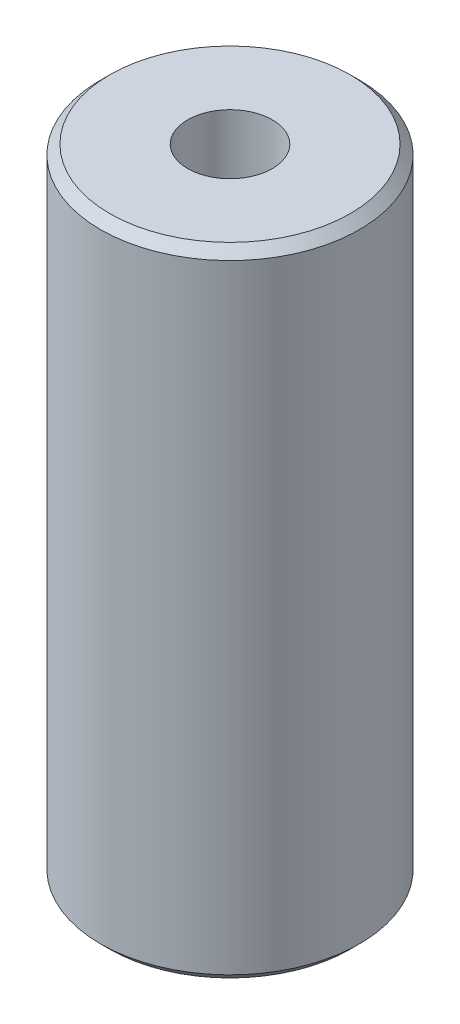
ISO-10303-21;
HEADER;
FILE_DESCRIPTION(('STEP AP214'),'2;1');
FILE_NAME('part.step','',(''),(''),'','','');
FILE_SCHEMA(('AUTOMOTIVE_DESIGN { 1 0 10303 214 1 1 1 1 }'));
ENDSEC;
DATA;
#1=APPLICATION_CONTEXT('core data for automotive mechanical design processes');
#2=APPLICATION_PROTOCOL_DEFINITION('international standard','automotive_design',2000,#1);
#3=PRODUCT_CONTEXT('',#1,'mechanical');
#4=PRODUCT('Part','Part','',(#3));
#5=PRODUCT_RELATED_PRODUCT_CATEGORY('part','',(#4));
#6=PRODUCT_DEFINITION_FORMATION('','',#4);
#7=PRODUCT_DEFINITION_CONTEXT('part definition',#1,'design');
#8=PRODUCT_DEFINITION('design','',#6,#7);
#9=PRODUCT_DEFINITION_SHAPE('','',#8);
#10=(LENGTH_UNIT() NAMED_UNIT(*) SI_UNIT(.MILLI.,.METRE.));
#11=(NAMED_UNIT(*) PLANE_ANGLE_UNIT() SI_UNIT($,.RADIAN.));
#12=(NAMED_UNIT(*) SI_UNIT($,.STERADIAN.) SOLID_ANGLE_UNIT());
#13=UNCERTAINTY_MEASURE_WITH_UNIT(LENGTH_MEASURE(1.E-05),#10,'distance_accuracy_value','');
#14=(GEOMETRIC_REPRESENTATION_CONTEXT(3) GLOBAL_UNCERTAINTY_ASSIGNED_CONTEXT((#13)) GLOBAL_UNIT_ASSIGNED_CONTEXT((#10,
#11,#12)) REPRESENTATION_CONTEXT('',''));
#15=CARTESIAN_POINT('',(0.,0.,0.));
#16=DIRECTION('',(0.,0.,1.));
#17=DIRECTION('',(1.,0.,0.));
#18=AXIS2_PLACEMENT_3D('',#15,#16,#17);
#19=CARTESIAN_POINT('',(0.,221.366290043515,0.));
#20=DIRECTION('',(0.,-1.,0.));
#21=DIRECTION('',(0.,0.,-1.));
#22=AXIS2_PLACEMENT_3D('',#19,#20,#21);
#23=CYLINDRICAL_SURFACE('',#22,45.);
#24=CARTESIAN_POINT('',(0.,218.158806298416,0.));
#25=DIRECTION('',(0.,1.,0.));
#26=DIRECTION('',(0.,0.,1.));
#27=AXIS2_PLACEMENT_3D('',#24,#25,#26);
#28=CIRCLE('',#27,45.);
#29=CARTESIAN_POINT('',(0.,218.158806298416,-45.));
#30=VERTEX_POINT('',#29);
#31=EDGE_CURVE('E50',#30,#30,#28,.F.);
#32=ORIENTED_EDGE('',*,*,#31,.T.);
#33=EDGE_LOOP('',(#32));
#34=FACE_BOUND('',#33,.T.);
#35=CARTESIAN_POINT('',(0.,3.20748374509863,0.));
#36=DIRECTION('',(0.,1.,0.));
#37=DIRECTION('',(0.,0.,1.));
#38=AXIS2_PLACEMENT_3D('',#35,#36,#37);
#39=CIRCLE('',#38,45.);
#40=CARTESIAN_POINT('',(0.,3.20748374509863,45.));
#41=VERTEX_POINT('',#40);
#42=EDGE_CURVE('E51',#41,#41,#39,.T.);
#43=ORIENTED_EDGE('',*,*,#42,.T.);
#44=EDGE_LOOP('',(#43));
#45=FACE_BOUND('',#44,.T.);
#46=ADVANCED_FACE('F39',(#34,#45),#23,.T.);
#47=CARTESIAN_POINT('',(0.,221.366290043515,0.));
#48=DIRECTION('',(0.,1.,0.));
#49=DIRECTION('',(0.,0.,1.));
#50=AXIS2_PLACEMENT_3D('',#47,#48,#49);
#51=PLANE('',#50);
#52=CARTESIAN_POINT('',(0.,221.366290043515,0.));
#53=DIRECTION('',(0.,1.,0.));
#54=DIRECTION('',(0.,0.,1.));
#55=AXIS2_PLACEMENT_3D('',#52,#53,#54);
#56=CIRCLE('',#55,41.7925162549013);
#57=CARTESIAN_POINT('',(0.,221.366290043515,-41.7925162549013));
#58=VERTEX_POINT('',#57);
#59=EDGE_CURVE('E54',#58,#58,#56,.T.);
#60=ORIENTED_EDGE('',*,*,#59,.T.);
#61=EDGE_LOOP('',(#60));
#62=FACE_BOUND('',#61,.T.);
#63=CARTESIAN_POINT('',(0.,221.366290043515,0.));
#64=DIRECTION('',(0.,1.,0.));
#65=DIRECTION('',(0.,0.,1.));
#66=AXIS2_PLACEMENT_3D('',#63,#64,#65);
#67=CIRCLE('',#66,14.7054693619186);
#68=CARTESIAN_POINT('',(0.,221.366290043515,14.7054693619186));
#69=VERTEX_POINT('',#68);
#70=EDGE_CURVE('E58',#69,#69,#67,.T.);
#71=ORIENTED_EDGE('',*,*,#70,.F.);
#72=EDGE_LOOP('',(#71));
#73=FACE_BOUND('',#72,.T.);
#74=ADVANCED_FACE('F69',(#62,#73),#51,.T.);
#75=CARTESIAN_POINT('',(0.,0.,0.));
#76=DIRECTION('',(0.,1.,0.));
#77=DIRECTION('',(0.,0.,1.));
#78=AXIS2_PLACEMENT_3D('',#75,#76,#77);
#79=PLANE('',#78);
#80=CARTESIAN_POINT('',(0.,0.,0.));
#81=DIRECTION('',(0.,1.,0.));
#82=DIRECTION('',(0.,0.,1.));
#83=AXIS2_PLACEMENT_3D('',#80,#81,#82);
#84=CIRCLE('',#83,41.7925162549014);
#85=CARTESIAN_POINT('',(0.,0.,41.7925162549014));
#86=VERTEX_POINT('',#85);
#87=EDGE_CURVE('E10',#86,#86,#84,.F.);
#88=ORIENTED_EDGE('',*,*,#87,.T.);
#89=EDGE_LOOP('',(#88));
#90=FACE_BOUND('',#89,.T.);
#91=CARTESIAN_POINT('',(0.,0.,0.));
#92=DIRECTION('',(0.,1.,0.));
#93=DIRECTION('',(0.,0.,1.));
#94=AXIS2_PLACEMENT_3D('',#91,#92,#93);
#95=CIRCLE('',#94,14.7054693619186);
#96=CARTESIAN_POINT('',(0.,0.,14.7054693619186));
#97=VERTEX_POINT('',#96);
#98=EDGE_CURVE('E63',#97,#97,#95,.T.);
#99=ORIENTED_EDGE('',*,*,#98,.T.);
#100=EDGE_LOOP('',(#99));
#101=FACE_BOUND('',#100,.T.);
#102=ADVANCED_FACE('F75',(#90,#101),#79,.F.);
#103=CARTESIAN_POINT('',(0.,221.366290043515,0.));
#104=DIRECTION('',(0.,-1.,0.));
#105=DIRECTION('',(0.,0.,-1.));
#106=AXIS2_PLACEMENT_3D('',#103,#104,#105);
#107=CYLINDRICAL_SURFACE('',#106,14.7054693619186);
#108=ORIENTED_EDGE('',*,*,#70,.T.);
#109=EDGE_LOOP('',(#108));
#110=FACE_BOUND('',#109,.T.);
#111=ORIENTED_EDGE('',*,*,#98,.F.);
#112=EDGE_LOOP('',(#111));
#113=FACE_BOUND('',#112,.T.);
#114=ADVANCED_FACE('F70',(#110,#113),#107,.F.);
#115=CARTESIAN_POINT('',(0.,221.366290043515,0.));
#116=DIRECTION('',(0.,-1.,0.));
#117=DIRECTION('',(0.,0.,-1.));
#118=AXIS2_PLACEMENT_3D('',#115,#116,#117);
#119=CONICAL_SURFACE('',#118,41.7925162549013,0.785398163397443);
#120=CARTESIAN_POINT('',(0.,218.158806298416,-45.));
#121=CARTESIAN_POINT('',(0.,218.192217587428,-44.9665887109886));
#122=CARTESIAN_POINT('',(0.,218.225628876439,-44.9331774219771));
#123=CARTESIAN_POINT('',(0.,218.292451454462,-44.8663548439542));
#124=CARTESIAN_POINT('',(0.,218.325862743474,-44.8329435549428));
#125=CARTESIAN_POINT('',(0.,218.392685321496,-44.7661209769199));
#126=CARTESIAN_POINT('',(0.,218.426096610508,-44.7327096879085));
#127=CARTESIAN_POINT('',(0.,218.492919188531,-44.6658871098856));
#128=CARTESIAN_POINT('',(0.,218.526330477542,-44.6324758208741));
#129=CARTESIAN_POINT('',(0.,218.593153055565,-44.5656532428512));
#130=CARTESIAN_POINT('',(0.,218.626564344577,-44.5322419538398));
#131=CARTESIAN_POINT('',(0.,218.6933869226,-44.4654193758169));
#132=CARTESIAN_POINT('',(0.,218.726798211611,-44.4320080868055));
#133=CARTESIAN_POINT('',(0.,218.793620789634,-44.3651855087826));
#134=CARTESIAN_POINT('',(0.,218.827032078645,-44.3317742197711));
#135=CARTESIAN_POINT('',(0.,218.893854656668,-44.2649516417482));
#136=CARTESIAN_POINT('',(0.,218.92726594568,-44.2315403527368));
#137=CARTESIAN_POINT('',(0.,218.994088523703,-44.1647177747139));
#138=CARTESIAN_POINT('',(0.,219.027499812714,-44.1313064857025));
#139=CARTESIAN_POINT('',(0.,219.094322390737,-44.0644839076796));
#140=CARTESIAN_POINT('',(0.,219.127733679748,-44.0310726186681));
#141=CARTESIAN_POINT('',(0.,219.194556257771,-43.9642500406452));
#142=CARTESIAN_POINT('',(0.,219.227967546783,-43.9308387516338));
#143=CARTESIAN_POINT('',(0.,219.294790124806,-43.8640161736109));
#144=CARTESIAN_POINT('',(0.,219.328201413817,-43.8306048845995));
#145=CARTESIAN_POINT('',(0.,219.39502399184,-43.7637823065766));
#146=CARTESIAN_POINT('',(0.,219.428435280851,-43.7303710175651));
#147=CARTESIAN_POINT('',(0.,219.495257858874,-43.6635484395422));
#148=CARTESIAN_POINT('',(0.,219.528669147886,-43.6301371505308));
#149=CARTESIAN_POINT('',(0.,219.595491725909,-43.5633145725079));
#150=CARTESIAN_POINT('',(0.,219.62890301492,-43.5299032834965));
#151=CARTESIAN_POINT('',(0.,219.695725592943,-43.4630807054736));
#152=CARTESIAN_POINT('',(0.,219.729136881954,-43.4296694164621));
#153=CARTESIAN_POINT('',(0.,219.795959459977,-43.3628468384392));
#154=CARTESIAN_POINT('',(0.,219.829370748989,-43.3294355494278));
#155=CARTESIAN_POINT('',(0.,219.896193327012,-43.2626129714049));
#156=CARTESIAN_POINT('',(0.,219.929604616023,-43.2292016823935));
#157=CARTESIAN_POINT('',(0.,219.996427194046,-43.1623791043706));
#158=CARTESIAN_POINT('',(0.,220.029838483057,-43.1289678153591));
#159=CARTESIAN_POINT('',(0.,220.09666106108,-43.0621452373362));
#160=CARTESIAN_POINT('',(0.,220.130072350092,-43.0287339483248));
#161=CARTESIAN_POINT('',(0.,220.196894928115,-42.9619113703019));
#162=CARTESIAN_POINT('',(0.,220.230306217126,-42.9285000812905));
#163=CARTESIAN_POINT('',(0.,220.297128795149,-42.8616775032676));
#164=CARTESIAN_POINT('',(0.,220.33054008416,-42.8282662142561));
#165=CARTESIAN_POINT('',(0.,220.397362662183,-42.7614436362332));
#166=CARTESIAN_POINT('',(0.,220.430773951195,-42.7280323472218));
#167=CARTESIAN_POINT('',(0.,220.497596529218,-42.6612097691989));
#168=CARTESIAN_POINT('',(0.,220.531007818229,-42.6277984801875));
#169=CARTESIAN_POINT('',(0.,220.597830396252,-42.5609759021646));
#170=CARTESIAN_POINT('',(0.,220.631241685263,-42.5275646131531));
#171=CARTESIAN_POINT('',(0.,220.698064263286,-42.4607420351302));
#172=CARTESIAN_POINT('',(0.,220.731475552298,-42.4273307461188));
#173=CARTESIAN_POINT('',(0.,220.798298130321,-42.3605081680959));
#174=CARTESIAN_POINT('',(0.,220.831709419332,-42.3270968790845));
#175=CARTESIAN_POINT('',(0.,220.898531997355,-42.2602743010616));
#176=CARTESIAN_POINT('',(0.,220.931943286366,-42.2268630120501));
#177=CARTESIAN_POINT('',(0.,220.998765864389,-42.1600404340272));
#178=CARTESIAN_POINT('',(0.,221.032177153401,-42.1266291450158));
#179=CARTESIAN_POINT('',(0.,221.098999731424,-42.0598065669929));
#180=CARTESIAN_POINT('',(0.,221.132411020435,-42.0263952779815));
#181=CARTESIAN_POINT('',(0.,221.199233598458,-41.9595726999586));
#182=CARTESIAN_POINT('',(0.,221.232644887469,-41.9261614109471));
#183=CARTESIAN_POINT('',(0.,221.299467465492,-41.8593388329242));
#184=CARTESIAN_POINT('',(0.,221.332878754504,-41.8259275439128));
#185=CARTESIAN_POINT('',(0.,221.366290043515,-41.7925162549013));
#186=B_SPLINE_CURVE_WITH_KNOTS('',3,(#120,#121,#122,#123,#124,#125,#126,#127,#128,#129,#130,
#131,#132,#133,#134,#135,#136,#137,#138,#139,#140,#141,#142,#143,#144,#145,#146,#147,#148,#149,
#150,#151,#152,#153,#154,#155,#156,#157,#158,#159,#160,#161,#162,#163,#164,#165,#166,#167,#168,
#169,#170,#171,#172,#173,#174,#175,#176,#177,#178,#179,#180,#181,#182,#183,#184,#185),
.UNSPECIFIED.,.F.,.F.,(4,2,2,2,2,2,2,2,2,2,2,2,2,2,2,2,2,2,2,2,2,2,2,2,2,2,2,2,2,2,2,2,4),(0.,
0.141752094169038,0.283504188338101,0.425256282507159,0.567008376676217,0.70876047084528,
0.850512565014337,0.992264659183395,1.13401675335246,1.2757688475215,1.41752094169055,
1.55927303585962,1.70102513002867,1.84277722419773,1.9845293183668,2.12628141253585,
2.26803350670491,2.40978560087395,2.55153769504301,2.69328978921207,2.83504188338113,
2.97679397755019,3.11854607171925,3.26029816588831,3.40205026005737,3.54380235422641,
3.68555444839547,3.82730654256453,3.96905863673359,4.11081073090265,4.25256282507171,
4.39431491924077,4.53606701340983),.UNSPECIFIED.);
#187=EDGE_CURVE('BSEAM81',#30,#58,#186,.T.);
#188=ORIENTED_EDGE('',*,*,#31,.F.);
#189=ORIENTED_EDGE('',*,*,#59,.F.);
#190=ORIENTED_EDGE('',*,*,#187,.T.);
#191=ORIENTED_EDGE('',*,*,#187,.F.);
#192=EDGE_LOOP('',(#188,#190,#189,#191));
#193=FACE_BOUND('',#192,.T.);
#194=ADVANCED_FACE('F81',(#193),#119,.T.);
#195=CARTESIAN_POINT('',(0.,3.20748374509863,0.));
#196=DIRECTION('',(0.,1.,0.));
#197=DIRECTION('',(0.,0.,1.));
#198=AXIS2_PLACEMENT_3D('',#195,#196,#197);
#199=CONICAL_SURFACE('',#198,45.,0.785398163397448);
#200=ORIENTED_EDGE('',*,*,#87,.F.);
#201=EDGE_LOOP('',(#200));
#202=FACE_BOUND('',#201,.T.);
#203=ORIENTED_EDGE('',*,*,#42,.F.);
#204=EDGE_LOOP('',(#203));
#205=FACE_BOUND('',#204,.T.);
#206=ADVANCED_FACE('F45',(#202,#205),#199,.T.);
#207=CLOSED_SHELL('',(#46,#74,#102,#114,#194,#206));
#208=MANIFOLD_SOLID_BREP('B2',#207);
#209=ADVANCED_BREP_SHAPE_REPRESENTATION('',(#18,#208),#14);
#210=SHAPE_DEFINITION_REPRESENTATION(#9,#209);
ENDSEC;
END-ISO-10303-21;
